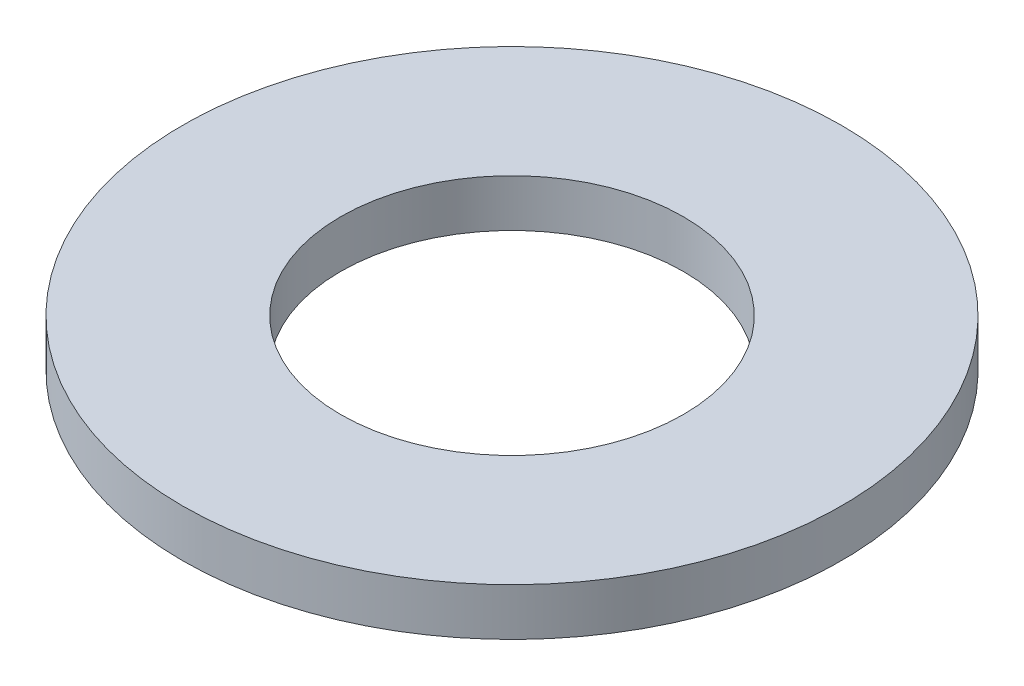
ISO-10303-21;
HEADER;
FILE_DESCRIPTION(('STEP AP214'),'2;1');
FILE_NAME('part.step','',(''),(''),'','','');
FILE_SCHEMA(('AUTOMOTIVE_DESIGN { 1 0 10303 214 1 1 1 1 }'));
ENDSEC;
DATA;
#1=APPLICATION_CONTEXT('core data for automotive mechanical design processes');
#2=APPLICATION_PROTOCOL_DEFINITION('international standard','automotive_design',2000,#1);
#3=PRODUCT_CONTEXT('',#1,'mechanical');
#4=PRODUCT('Part','Part','',(#3));
#5=PRODUCT_RELATED_PRODUCT_CATEGORY('part','',(#4));
#6=PRODUCT_DEFINITION_FORMATION('','',#4);
#7=PRODUCT_DEFINITION_CONTEXT('part definition',#1,'design');
#8=PRODUCT_DEFINITION('design','',#6,#7);
#9=PRODUCT_DEFINITION_SHAPE('','',#8);
#10=(LENGTH_UNIT() NAMED_UNIT(*) SI_UNIT(.MILLI.,.METRE.));
#11=(NAMED_UNIT(*) PLANE_ANGLE_UNIT() SI_UNIT($,.RADIAN.));
#12=(NAMED_UNIT(*) SI_UNIT($,.STERADIAN.) SOLID_ANGLE_UNIT());
#13=UNCERTAINTY_MEASURE_WITH_UNIT(LENGTH_MEASURE(1.E-05),#10,'distance_accuracy_value','');
#14=(GEOMETRIC_REPRESENTATION_CONTEXT(3) GLOBAL_UNCERTAINTY_ASSIGNED_CONTEXT((#13)) GLOBAL_UNIT_ASSIGNED_CONTEXT((#10,
#11,#12)) REPRESENTATION_CONTEXT('',''));
#15=CARTESIAN_POINT('',(0.,0.,0.));
#16=DIRECTION('',(0.,0.,1.));
#17=DIRECTION('',(1.,0.,0.));
#18=AXIS2_PLACEMENT_3D('',#15,#16,#17);
#19=CARTESIAN_POINT('',(0.,9.,0.));
#20=DIRECTION('',(0.,-1.,0.));
#21=DIRECTION('',(0.,0.,-1.));
#22=AXIS2_PLACEMENT_3D('',#19,#20,#21);
#23=CYLINDRICAL_SURFACE('',#22,62.5);
#24=CARTESIAN_POINT('',(0.,9.,0.));
#25=DIRECTION('',(0.,1.,0.));
#26=DIRECTION('',(0.,0.,1.));
#27=AXIS2_PLACEMENT_3D('',#24,#25,#26);
#28=CIRCLE('',#27,62.5);
#29=CARTESIAN_POINT('',(0.,9.,62.5));
#30=VERTEX_POINT('',#29);
#31=EDGE_CURVE('E10',#30,#30,#28,.T.);
#32=ORIENTED_EDGE('',*,*,#31,.F.);
#33=EDGE_LOOP('',(#32));
#34=FACE_BOUND('',#33,.T.);
#35=CARTESIAN_POINT('',(0.,0.,0.));
#36=DIRECTION('',(0.,1.,0.));
#37=DIRECTION('',(0.,0.,1.));
#38=AXIS2_PLACEMENT_3D('',#35,#36,#37);
#39=CIRCLE('',#38,62.5);
#40=CARTESIAN_POINT('',(0.,0.,62.5));
#41=VERTEX_POINT('',#40);
#42=EDGE_CURVE('E37',#41,#41,#39,.T.);
#43=ORIENTED_EDGE('',*,*,#42,.T.);
#44=EDGE_LOOP('',(#43));
#45=FACE_BOUND('',#44,.T.);
#46=ADVANCED_FACE('F40',(#34,#45),#23,.T.);
#47=CARTESIAN_POINT('',(0.,9.,0.));
#48=DIRECTION('',(0.,1.,0.));
#49=DIRECTION('',(0.,0.,1.));
#50=AXIS2_PLACEMENT_3D('',#47,#48,#49);
#51=PLANE('',#50);
#52=CARTESIAN_POINT('',(0.,9.,0.));
#53=DIRECTION('',(0.,1.,0.));
#54=DIRECTION('',(0.,0.,1.));
#55=AXIS2_PLACEMENT_3D('',#52,#53,#54);
#56=CIRCLE('',#55,32.5);
#57=CARTESIAN_POINT('',(0.,9.,32.5));
#58=VERTEX_POINT('',#57);
#59=EDGE_CURVE('E50',#58,#58,#56,.T.);
#60=ORIENTED_EDGE('',*,*,#59,.F.);
#61=EDGE_LOOP('',(#60));
#62=FACE_BOUND('',#61,.T.);
#63=ORIENTED_EDGE('',*,*,#31,.T.);
#64=EDGE_LOOP('',(#63));
#65=FACE_BOUND('',#64,.T.);
#66=ADVANCED_FACE('F59',(#62,#65),#51,.T.);
#67=CARTESIAN_POINT('',(0.,0.,0.));
#68=DIRECTION('',(0.,1.,0.));
#69=DIRECTION('',(0.,0.,1.));
#70=AXIS2_PLACEMENT_3D('',#67,#68,#69);
#71=PLANE('',#70);
#72=CARTESIAN_POINT('',(0.,0.,0.));
#73=DIRECTION('',(0.,1.,0.));
#74=DIRECTION('',(0.,0.,1.));
#75=AXIS2_PLACEMENT_3D('',#72,#73,#74);
#76=CIRCLE('',#75,32.5);
#77=CARTESIAN_POINT('',(0.,0.,32.5));
#78=VERTEX_POINT('',#77);
#79=EDGE_CURVE('E47',#78,#78,#76,.T.);
#80=ORIENTED_EDGE('',*,*,#79,.T.);
#81=EDGE_LOOP('',(#80));
#82=FACE_BOUND('',#81,.T.);
#83=ORIENTED_EDGE('',*,*,#42,.F.);
#84=EDGE_LOOP('',(#83));
#85=FACE_BOUND('',#84,.T.);
#86=ADVANCED_FACE('F58',(#82,#85),#71,.F.);
#87=CARTESIAN_POINT('',(0.,9.,0.));
#88=DIRECTION('',(0.,-1.,0.));
#89=DIRECTION('',(0.,0.,-1.));
#90=AXIS2_PLACEMENT_3D('',#87,#88,#89);
#91=CYLINDRICAL_SURFACE('',#90,32.5);
#92=ORIENTED_EDGE('',*,*,#59,.T.);
#93=EDGE_LOOP('',(#92));
#94=FACE_BOUND('',#93,.T.);
#95=ORIENTED_EDGE('',*,*,#79,.F.);
#96=EDGE_LOOP('',(#95));
#97=FACE_BOUND('',#96,.T.);
#98=ADVANCED_FACE('F54',(#94,#97),#91,.F.);
#99=CLOSED_SHELL('',(#46,#66,#86,#98));
#100=MANIFOLD_SOLID_BREP('B2',#99);
#101=ADVANCED_BREP_SHAPE_REPRESENTATION('',(#18,#100),#14);
#102=SHAPE_DEFINITION_REPRESENTATION(#9,#101);
ENDSEC;
END-ISO-10303-21;
